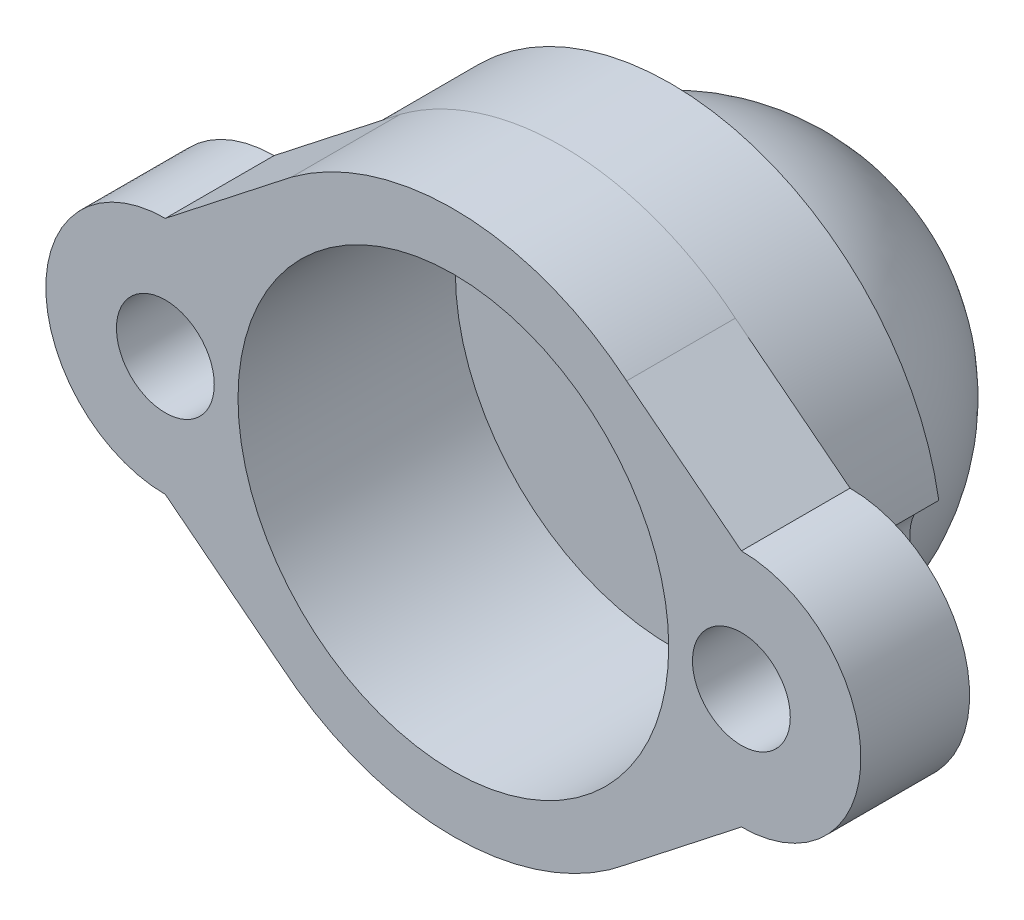
ISO-10303-21;
HEADER;
FILE_DESCRIPTION(('STEP AP214'),'2;1');
FILE_NAME('part.step','',(''),(''),'','','');
FILE_SCHEMA(('AUTOMOTIVE_DESIGN { 1 0 10303 214 1 1 1 1 }'));
ENDSEC;
DATA;
#1=APPLICATION_CONTEXT('core data for automotive mechanical design processes');
#2=APPLICATION_PROTOCOL_DEFINITION('international standard','automotive_design',2000,#1);
#3=PRODUCT_CONTEXT('',#1,'mechanical');
#4=PRODUCT('Part','Part','',(#3));
#5=PRODUCT_RELATED_PRODUCT_CATEGORY('part','',(#4));
#6=PRODUCT_DEFINITION_FORMATION('','',#4);
#7=PRODUCT_DEFINITION_CONTEXT('part definition',#1,'design');
#8=PRODUCT_DEFINITION('design','',#6,#7);
#9=PRODUCT_DEFINITION_SHAPE('','',#8);
#10=(LENGTH_UNIT() NAMED_UNIT(*) SI_UNIT(.MILLI.,.METRE.));
#11=(NAMED_UNIT(*) PLANE_ANGLE_UNIT() SI_UNIT($,.RADIAN.));
#12=(NAMED_UNIT(*) SI_UNIT($,.STERADIAN.) SOLID_ANGLE_UNIT());
#13=UNCERTAINTY_MEASURE_WITH_UNIT(LENGTH_MEASURE(1.E-05),#10,'distance_accuracy_value','');
#14=(GEOMETRIC_REPRESENTATION_CONTEXT(3) GLOBAL_UNCERTAINTY_ASSIGNED_CONTEXT((#13)) GLOBAL_UNIT_ASSIGNED_CONTEXT((#10,
#11,#12)) REPRESENTATION_CONTEXT('',''));
#15=CARTESIAN_POINT('',(0.,0.,0.));
#16=DIRECTION('',(0.,0.,1.));
#17=DIRECTION('',(1.,0.,0.));
#18=AXIS2_PLACEMENT_3D('',#15,#16,#17);
#19=CARTESIAN_POINT('',(-5.21556619172103,-6.6591934788986,2.54));
#20=DIRECTION('',(0.61660321136518,0.787274081711158,0.));
#21=DIRECTION('',(-0.787274081711158,0.61660321136518,0.));
#22=AXIS2_PLACEMENT_3D('',#19,#20,#21);
#23=PLANE('',#22);
#24=DIRECTION('',(0.787274081711159,-0.61660321136518,0.));
#25=VECTOR('',#24,1.);
#26=CARTESIAN_POINT('',(-5.21556619172103,-6.6591934788986,0.));
#27=LINE('',#26,#25);
#28=CARTESIAN_POINT('',(-5.57405324459235,-6.37842179700499,0.));
#29=VERTEX_POINT('',#28);
#30=CARTESIAN_POINT('',(-2.89267694980769,-8.47851028289685,0.));
#31=VERTEX_POINT('',#30);
#32=EDGE_CURVE('E149',#29,#31,#27,.T.);
#33=ORIENTED_EDGE('',*,*,#32,.T.);
#34=DIRECTION('',(0.,0.,-1.));
#35=VECTOR('',#34,1.);
#36=CARTESIAN_POINT('',(-2.89267694980769,-8.47851028289685,2.54));
#37=LINE('',#36,#35);
#38=CARTESIAN_POINT('',(-2.89267694980769,-8.47851028289685,2.54));
#39=VERTEX_POINT('',#38);
#40=EDGE_CURVE('E38',#39,#31,#37,.T.);
#41=ORIENTED_EDGE('',*,*,#40,.F.);
#42=DIRECTION('',(0.787274081711159,-0.61660321136518,0.));
#43=VECTOR('',#42,1.);
#44=CARTESIAN_POINT('',(-5.21556619172103,-6.6591934788986,2.54));
#45=LINE('',#44,#43);
#46=CARTESIAN_POINT('',(-5.57405324459235,-6.37842179700499,2.54));
#47=VERTEX_POINT('',#46);
#48=EDGE_CURVE('E158',#47,#39,#45,.T.);
#49=ORIENTED_EDGE('',*,*,#48,.F.);
#50=DIRECTION('',(0.,0.,-1.));
#51=VECTOR('',#50,1.);
#52=CARTESIAN_POINT('',(-5.57405324459235,-6.37842179700499,2.54));
#53=LINE('',#52,#51);
#54=EDGE_CURVE('E183',#47,#29,#53,.T.);
#55=ORIENTED_EDGE('',*,*,#54,.T.);
#56=EDGE_LOOP('',(#33,#41,#49,#55));
#57=FACE_BOUND('',#56,.T.);
#58=ADVANCED_FACE('F34',(#57),#23,.F.);
#59=CARTESIAN_POINT('',(1.15694675540765,-3.58442179700499,2.54));
#60=DIRECTION('',(0.,0.,-1.));
#61=DIRECTION('',(-1.,0.,0.));
#62=AXIS2_PLACEMENT_3D('',#59,#60,#61);
#63=CYLINDRICAL_SURFACE('',#62,6.35228732517518);
#64=CARTESIAN_POINT('',(1.15694675540765,-3.58442179700499,0.));
#65=DIRECTION('',(0.,0.,1.));
#66=DIRECTION('',(1.,0.,0.));
#67=AXIS2_PLACEMENT_3D('',#64,#65,#66);
#68=CIRCLE('',#67,6.35228732517518);
#69=CARTESIAN_POINT('',(5.20657046062299,-8.47851028289685,0.));
#70=VERTEX_POINT('',#69);
#71=EDGE_CURVE('E187',#31,#70,#68,.T.);
#72=ORIENTED_EDGE('',*,*,#71,.T.);
#73=DIRECTION('',(0.,0.,-1.));
#74=VECTOR('',#73,1.);
#75=CARTESIAN_POINT('',(5.20657046062299,-8.47851028289685,2.54));
#76=LINE('',#75,#74);
#77=CARTESIAN_POINT('',(5.20657046062299,-8.47851028289685,2.54));
#78=VERTEX_POINT('',#77);
#79=EDGE_CURVE('E220',#78,#70,#76,.T.);
#80=ORIENTED_EDGE('',*,*,#79,.F.);
#81=CARTESIAN_POINT('',(1.15694675540765,-3.58442179700499,2.54));
#82=DIRECTION('',(0.,0.,1.));
#83=DIRECTION('',(1.,0.,0.));
#84=AXIS2_PLACEMENT_3D('',#81,#82,#83);
#85=CIRCLE('',#84,6.35228732517518);
#86=EDGE_CURVE('E162',#39,#78,#85,.T.);
#87=ORIENTED_EDGE('',*,*,#86,.F.);
#88=ORIENTED_EDGE('',*,*,#40,.T.);
#89=EDGE_LOOP('',(#72,#80,#87,#88));
#90=FACE_BOUND('',#89,.T.);
#91=ADVANCED_FACE('F227',(#90),#63,.T.);
#92=CARTESIAN_POINT('',(6.09530739447928,-7.78244005753957,2.54));
#93=DIRECTION('',(0.61660321136518,-0.787274081711159,0.));
#94=DIRECTION('',(0.787274081711158,0.61660321136518,0.));
#95=AXIS2_PLACEMENT_3D('',#92,#93,#94);
#96=PLANE('',#95);
#97=DIRECTION('',(-0.787274081711158,-0.616603211365179,0.));
#98=VECTOR('',#97,1.);
#99=CARTESIAN_POINT('',(6.09530739447928,-7.78244005753957,0.));
#100=LINE('',#99,#98);
#101=CARTESIAN_POINT('',(7.88794675540765,-6.37842179700499,0.));
#102=VERTEX_POINT('',#101);
#103=EDGE_CURVE('E190',#102,#70,#100,.T.);
#104=ORIENTED_EDGE('',*,*,#103,.F.);
#105=DIRECTION('',(0.,0.,-1.));
#106=VECTOR('',#105,1.);
#107=CARTESIAN_POINT('',(7.88794675540765,-6.37842179700499,2.54));
#108=LINE('',#107,#106);
#109=CARTESIAN_POINT('',(7.88794675540765,-6.37842179700499,2.54));
#110=VERTEX_POINT('',#109);
#111=EDGE_CURVE('E219',#110,#102,#108,.T.);
#112=ORIENTED_EDGE('',*,*,#111,.F.);
#113=DIRECTION('',(-0.787274081711158,-0.616603211365179,0.));
#114=VECTOR('',#113,1.);
#115=CARTESIAN_POINT('',(6.09530739447928,-7.78244005753957,2.54));
#116=LINE('',#115,#114);
#117=EDGE_CURVE('E164',#110,#78,#116,.T.);
#118=ORIENTED_EDGE('',*,*,#117,.T.);
#119=ORIENTED_EDGE('',*,*,#79,.T.);
#120=EDGE_LOOP('',(#104,#112,#118,#119));
#121=FACE_BOUND('',#120,.T.);
#122=ADVANCED_FACE('F237',(#121),#96,.T.);
#123=CARTESIAN_POINT('',(7.88794675540765,-3.58442179700499,2.54));
#124=DIRECTION('',(0.,0.,-1.));
#125=DIRECTION('',(-1.,0.,0.));
#126=AXIS2_PLACEMENT_3D('',#123,#124,#125);
#127=CYLINDRICAL_SURFACE('',#126,2.794);
#128=CARTESIAN_POINT('',(7.88794675540765,-3.58442179700499,0.));
#129=DIRECTION('',(0.,0.,1.));
#130=DIRECTION('',(1.,0.,0.));
#131=AXIS2_PLACEMENT_3D('',#128,#129,#130);
#132=CIRCLE('',#131,2.794);
#133=CARTESIAN_POINT('',(7.88794675540765,-0.790421797004992,0.));
#134=VERTEX_POINT('',#133);
#135=EDGE_CURVE('E193',#102,#134,#132,.T.);
#136=ORIENTED_EDGE('',*,*,#135,.T.);
#137=DIRECTION('',(0.,0.,-1.));
#138=VECTOR('',#137,1.);
#139=CARTESIAN_POINT('',(7.88794675540765,-0.790421797004992,2.54));
#140=LINE('',#139,#138);
#141=CARTESIAN_POINT('',(7.88794675540765,-0.790421797004992,2.54));
#142=VERTEX_POINT('',#141);
#143=EDGE_CURVE('E216',#142,#134,#140,.T.);
#144=ORIENTED_EDGE('',*,*,#143,.F.);
#145=CARTESIAN_POINT('',(7.88794675540765,-3.58442179700499,2.54));
#146=DIRECTION('',(0.,0.,1.));
#147=DIRECTION('',(1.,0.,0.));
#148=AXIS2_PLACEMENT_3D('',#145,#146,#147);
#149=CIRCLE('',#148,2.794);
#150=EDGE_CURVE('E167',#110,#142,#149,.T.);
#151=ORIENTED_EDGE('',*,*,#150,.F.);
#152=ORIENTED_EDGE('',*,*,#111,.T.);
#153=EDGE_LOOP('',(#136,#144,#151,#152));
#154=FACE_BOUND('',#153,.T.);
#155=ADVANCED_FACE('F242',(#154),#127,.T.);
#156=CARTESIAN_POINT('',(2.61529459261675,3.33918735883311,2.54));
#157=DIRECTION('',(-0.61660321136518,-0.787274081711158,0.));
#158=DIRECTION('',(0.787274081711159,-0.61660321136518,0.));
#159=AXIS2_PLACEMENT_3D('',#156,#157,#158);
#160=PLANE('',#159);
#161=DIRECTION('',(-0.787274081711158,0.61660321136518,0.));
#162=VECTOR('',#161,1.);
#163=CARTESIAN_POINT('',(2.61529459261675,3.33918735883311,0.));
#164=LINE('',#163,#162);
#165=CARTESIAN_POINT('',(5.20657046062299,1.30966668888687,0.));
#166=VERTEX_POINT('',#165);
#167=EDGE_CURVE('E195',#134,#166,#164,.T.);
#168=ORIENTED_EDGE('',*,*,#167,.T.);
#169=DIRECTION('',(0.,0.,-1.));
#170=VECTOR('',#169,1.);
#171=CARTESIAN_POINT('',(5.20657046062299,1.30966668888687,2.54));
#172=LINE('',#171,#170);
#173=CARTESIAN_POINT('',(5.20657046062299,1.30966668888687,2.54));
#174=VERTEX_POINT('',#173);
#175=EDGE_CURVE('E213',#174,#166,#172,.T.);
#176=ORIENTED_EDGE('',*,*,#175,.F.);
#177=DIRECTION('',(-0.787274081711158,0.61660321136518,0.));
#178=VECTOR('',#177,1.);
#179=CARTESIAN_POINT('',(2.61529459261675,3.33918735883311,2.54));
#180=LINE('',#179,#178);
#181=EDGE_CURVE('E169',#142,#174,#180,.T.);
#182=ORIENTED_EDGE('',*,*,#181,.F.);
#183=ORIENTED_EDGE('',*,*,#143,.T.);
#184=EDGE_LOOP('',(#168,#176,#182,#183));
#185=FACE_BOUND('',#184,.T.);
#186=ADVANCED_FACE('F293',(#185),#160,.F.);
#187=CARTESIAN_POINT('',(1.15694675540765,-3.58442179700499,2.54));
#188=DIRECTION('',(0.,0.,-1.));
#189=DIRECTION('',(-1.,0.,0.));
#190=AXIS2_PLACEMENT_3D('',#187,#188,#189);
#191=CYLINDRICAL_SURFACE('',#190,6.35228732517518);
#192=CARTESIAN_POINT('',(1.15694675540765,-3.58442179700499,0.));
#193=DIRECTION('',(0.,0.,1.));
#194=DIRECTION('',(1.,0.,0.));
#195=AXIS2_PLACEMENT_3D('',#192,#193,#194);
#196=CIRCLE('',#195,6.35228732517518);
#197=CARTESIAN_POINT('',(-2.62429032371479,1.51987055483487,0.));
#198=VERTEX_POINT('',#197);
#199=EDGE_CURVE('E197',#166,#198,#196,.T.);
#200=ORIENTED_EDGE('',*,*,#199,.T.);
#201=DIRECTION('',(0.,0.,-1.));
#202=VECTOR('',#201,1.);
#203=CARTESIAN_POINT('',(-2.62429032371479,1.51987055483487,2.54));
#204=LINE('',#203,#202);
#205=CARTESIAN_POINT('',(-2.62429032371479,1.51987055483487,2.54));
#206=VERTEX_POINT('',#205);
#207=EDGE_CURVE('E210',#206,#198,#204,.T.);
#208=ORIENTED_EDGE('',*,*,#207,.F.);
#209=CARTESIAN_POINT('',(1.15694675540765,-3.58442179700499,2.54));
#210=DIRECTION('',(0.,0.,1.));
#211=DIRECTION('',(1.,0.,0.));
#212=AXIS2_PLACEMENT_3D('',#209,#210,#211);
#213=CIRCLE('',#212,6.35228732517518);
#214=EDGE_CURVE('E171',#174,#206,#213,.T.);
#215=ORIENTED_EDGE('',*,*,#214,.F.);
#216=ORIENTED_EDGE('',*,*,#175,.T.);
#217=EDGE_LOOP('',(#200,#208,#215,#216));
#218=FACE_BOUND('',#217,.T.);
#219=ADVANCED_FACE('F296',(#218),#191,.T.);
#220=CARTESIAN_POINT('',(-1.7355533898585,2.21594078019214,2.54));
#221=DIRECTION('',(-0.616603211365179,0.787274081711159,0.));
#222=DIRECTION('',(-0.787274081711159,-0.616603211365179,0.));
#223=AXIS2_PLACEMENT_3D('',#220,#221,#222);
#224=PLANE('',#223);
#225=DIRECTION('',(0.787274081711159,0.616603211365179,0.));
#226=VECTOR('',#225,1.);
#227=CARTESIAN_POINT('',(-1.7355533898585,2.21594078019214,0.));
#228=LINE('',#227,#226);
#229=CARTESIAN_POINT('',(-5.57405324459234,-0.790421797004991,0.));
#230=VERTEX_POINT('',#229);
#231=CARTESIAN_POINT('',(-2.75848363676124,1.41476862186087,0.));
#232=VERTEX_POINT('',#231);
#233=EDGE_CURVE('E201',#230,#232,#228,.T.);
#234=ORIENTED_EDGE('',*,*,#233,.F.);
#235=DIRECTION('',(0.,0.,-1.));
#236=VECTOR('',#235,1.);
#237=CARTESIAN_POINT('',(-5.57405324459234,-0.790421797004991,2.54));
#238=LINE('',#237,#236);
#239=CARTESIAN_POINT('',(-5.57405324459234,-0.790421797004991,2.54));
#240=VERTEX_POINT('',#239);
#241=EDGE_CURVE('E208',#240,#230,#238,.T.);
#242=ORIENTED_EDGE('',*,*,#241,.F.);
#243=DIRECTION('',(0.787274081711159,0.616603211365179,0.));
#244=VECTOR('',#243,1.);
#245=CARTESIAN_POINT('',(-1.7355533898585,2.21594078019214,2.54));
#246=LINE('',#245,#244);
#247=EDGE_CURVE('E173',#240,#206,#246,.T.);
#248=ORIENTED_EDGE('',*,*,#247,.T.);
#249=ORIENTED_EDGE('',*,*,#207,.T.);
#250=EDGE_CURVE('E200',#232,#198,#228,.T.);
#251=ORIENTED_EDGE('',*,*,#250,.F.);
#252=EDGE_LOOP('',(#234,#242,#248,#249,#251));
#253=FACE_BOUND('',#252,.T.);
#254=ADVANCED_FACE('F252',(#253),#224,.T.);
#255=CARTESIAN_POINT('',(-5.57405324459235,-3.58442179700499,2.54));
#256=DIRECTION('',(0.,0.,-1.));
#257=DIRECTION('',(-1.,0.,0.));
#258=AXIS2_PLACEMENT_3D('',#255,#256,#257);
#259=CYLINDRICAL_SURFACE('',#258,1.143);
#260=CARTESIAN_POINT('',(-5.57405324459235,-3.58442179700499,2.54));
#261=DIRECTION('',(0.,0.,1.));
#262=DIRECTION('',(1.,0.,0.));
#263=AXIS2_PLACEMENT_3D('',#260,#261,#262);
#264=CIRCLE('',#263,1.143);
#265=CARTESIAN_POINT('',(-4.43105324459235,-3.58442179700499,2.54));
#266=VERTEX_POINT('',#265);
#267=EDGE_CURVE('E178',#266,#266,#264,.T.);
#268=ORIENTED_EDGE('',*,*,#267,.T.);
#269=EDGE_LOOP('',(#268));
#270=FACE_BOUND('',#269,.T.);
#271=CARTESIAN_POINT('',(-5.57405324459235,-3.58442179700499,0.));
#272=DIRECTION('',(0.,0.,1.));
#273=DIRECTION('',(1.,0.,0.));
#274=AXIS2_PLACEMENT_3D('',#271,#272,#273);
#275=CIRCLE('',#274,1.143);
#276=CARTESIAN_POINT('',(-5.10678909364895,-2.54129514446315,0.));
#277=VERTEX_POINT('',#276);
#278=CARTESIAN_POINT('',(-5.10678909364895,-4.62754844954683,0.));
#279=VERTEX_POINT('',#278);
#280=EDGE_CURVE('E159',#277,#279,#275,.T.);
#281=ORIENTED_EDGE('',*,*,#280,.F.);
#282=DIRECTION('',(0.,0.,1.));
#283=VECTOR('',#282,1.);
#284=CARTESIAN_POINT('',(-5.10678909364895,-2.54129514446315,-2.54));
#285=LINE('',#284,#283);
#286=CARTESIAN_POINT('',(-5.10678909364895,-2.54129514446315,-2.54));
#287=VERTEX_POINT('',#286);
#288=EDGE_CURVE('E151',#287,#277,#285,.T.);
#289=ORIENTED_EDGE('',*,*,#288,.F.);
#290=CARTESIAN_POINT('',(-5.57405324459235,-3.58442179700499,-2.54));
#291=DIRECTION('',(0.,0.,1.));
#292=DIRECTION('',(-1.,0.,0.));
#293=AXIS2_PLACEMENT_3D('',#290,#291,#292);
#294=CIRCLE('',#293,1.143);
#295=CARTESIAN_POINT('',(-5.10678909364895,-4.62754844954683,-2.54));
#296=VERTEX_POINT('',#295);
#297=EDGE_CURVE('E135',#296,#287,#294,.T.);
#298=ORIENTED_EDGE('',*,*,#297,.F.);
#299=DIRECTION('',(0.,0.,1.));
#300=VECTOR('',#299,1.);
#301=CARTESIAN_POINT('',(-5.10678909364895,-4.62754844954683,-2.54));
#302=LINE('',#301,#300);
#303=EDGE_CURVE('E132',#296,#279,#302,.T.);
#304=ORIENTED_EDGE('',*,*,#303,.T.);
#305=EDGE_LOOP('',(#281,#289,#298,#304));
#306=FACE_BOUND('',#305,.T.);
#307=ADVANCED_FACE('F303',(#270,#306),#259,.F.);
#308=CARTESIAN_POINT('',(-5.57405324459235,-3.58442179700499,2.54));
#309=DIRECTION('',(0.,0.,-1.));
#310=DIRECTION('',(-1.,0.,0.));
#311=AXIS2_PLACEMENT_3D('',#308,#309,#310);
#312=CYLINDRICAL_SURFACE('',#311,2.794);
#313=CARTESIAN_POINT('',(-5.57405324459235,-3.58442179700499,0.));
#314=DIRECTION('',(0.,0.,1.));
#315=DIRECTION('',(1.,0.,0.));
#316=AXIS2_PLACEMENT_3D('',#313,#314,#315);
#317=CIRCLE('',#316,2.794);
#318=EDGE_CURVE('E203',#230,#29,#317,.T.);
#319=ORIENTED_EDGE('',*,*,#318,.T.);
#320=ORIENTED_EDGE('',*,*,#54,.F.);
#321=CARTESIAN_POINT('',(-5.57405324459235,-3.58442179700499,2.54));
#322=DIRECTION('',(0.,0.,1.));
#323=DIRECTION('',(1.,0.,0.));
#324=AXIS2_PLACEMENT_3D('',#321,#322,#323);
#325=CIRCLE('',#324,2.794);
#326=EDGE_CURVE('E176',#240,#47,#325,.T.);
#327=ORIENTED_EDGE('',*,*,#326,.F.);
#328=ORIENTED_EDGE('',*,*,#241,.T.);
#329=EDGE_LOOP('',(#319,#320,#327,#328));
#330=FACE_BOUND('',#329,.T.);
#331=ADVANCED_FACE('F250',(#330),#312,.T.);
#332=CARTESIAN_POINT('',(7.88794675540765,-3.58442179700499,2.54));
#333=DIRECTION('',(0.,0.,-1.));
#334=DIRECTION('',(-1.,0.,0.));
#335=AXIS2_PLACEMENT_3D('',#332,#333,#334);
#336=CYLINDRICAL_SURFACE('',#335,1.143);
#337=CARTESIAN_POINT('',(7.88794675540765,-3.58442179700499,2.54));
#338=DIRECTION('',(0.,0.,1.));
#339=DIRECTION('',(1.,0.,0.));
#340=AXIS2_PLACEMENT_3D('',#337,#338,#339);
#341=CIRCLE('',#340,1.143);
#342=CARTESIAN_POINT('',(9.03094675540765,-3.58442179700499,2.54));
#343=VERTEX_POINT('',#342);
#344=EDGE_CURVE('E155',#343,#343,#341,.T.);
#345=ORIENTED_EDGE('',*,*,#344,.T.);
#346=EDGE_LOOP('',(#345));
#347=FACE_BOUND('',#346,.T.);
#348=CARTESIAN_POINT('',(7.88794675540765,-3.58442179700499,0.));
#349=DIRECTION('',(0.,0.,1.));
#350=DIRECTION('',(1.,0.,0.));
#351=AXIS2_PLACEMENT_3D('',#348,#349,#350);
#352=CIRCLE('',#351,1.143);
#353=CARTESIAN_POINT('',(7.42068260446426,-4.62754844954683,0.));
#354=VERTEX_POINT('',#353);
#355=CARTESIAN_POINT('',(7.42068260446426,-2.54129514446315,0.));
#356=VERTEX_POINT('',#355);
#357=EDGE_CURVE('E147',#354,#356,#352,.T.);
#358=ORIENTED_EDGE('',*,*,#357,.F.);
#359=DIRECTION('',(0.,0.,1.));
#360=VECTOR('',#359,1.);
#361=CARTESIAN_POINT('',(7.42068260446426,-4.62754844954683,-2.54));
#362=LINE('',#361,#360);
#363=CARTESIAN_POINT('',(7.42068260446426,-4.62754844954683,-2.54));
#364=VERTEX_POINT('',#363);
#365=EDGE_CURVE('E130',#364,#354,#362,.T.);
#366=ORIENTED_EDGE('',*,*,#365,.F.);
#367=CARTESIAN_POINT('',(7.88794675540765,-3.58442179700499,-2.54));
#368=DIRECTION('',(0.,0.,1.));
#369=DIRECTION('',(-1.,0.,0.));
#370=AXIS2_PLACEMENT_3D('',#367,#368,#369);
#371=CIRCLE('',#370,1.143);
#372=CARTESIAN_POINT('',(7.42068260446426,-2.54129514446315,-2.54));
#373=VERTEX_POINT('',#372);
#374=EDGE_CURVE('E136',#373,#364,#371,.T.);
#375=ORIENTED_EDGE('',*,*,#374,.F.);
#376=DIRECTION('',(0.,0.,1.));
#377=VECTOR('',#376,1.);
#378=CARTESIAN_POINT('',(7.42068260446426,-2.54129514446315,-2.54));
#379=LINE('',#378,#377);
#380=EDGE_CURVE('E262',#373,#356,#379,.T.);
#381=ORIENTED_EDGE('',*,*,#380,.T.);
#382=EDGE_LOOP('',(#358,#366,#375,#381));
#383=FACE_BOUND('',#382,.T.);
#384=ADVANCED_FACE('F36',(#347,#383),#336,.F.);
#385=CARTESIAN_POINT('',(1.15694675540765,-3.58442179700499,2.54));
#386=DIRECTION('',(0.,0.,-1.));
#387=DIRECTION('',(-1.,0.,0.));
#388=AXIS2_PLACEMENT_3D('',#385,#386,#387);
#389=CYLINDRICAL_SURFACE('',#388,5.0330227);
#390=CARTESIAN_POINT('',(1.15694675540765,-3.58442179700499,2.54));
#391=DIRECTION('',(0.,0.,1.));
#392=DIRECTION('',(1.,0.,0.));
#393=AXIS2_PLACEMENT_3D('',#390,#391,#392);
#394=CIRCLE('',#393,5.0330227);
#395=CARTESIAN_POINT('',(6.18996945540765,-3.58442179700499,2.54));
#396=VERTEX_POINT('',#395);
#397=EDGE_CURVE('E181',#396,#396,#394,.T.);
#398=ORIENTED_EDGE('',*,*,#397,.T.);
#399=EDGE_LOOP('',(#398));
#400=FACE_BOUND('',#399,.T.);
#401=CARTESIAN_POINT('',(1.15694675540765,-3.58442179700499,-2.54));
#402=DIRECTION('',(0.,0.,-1.));
#403=DIRECTION('',(-1.,0.,0.));
#404=AXIS2_PLACEMENT_3D('',#401,#402,#403);
#405=CIRCLE('',#404,5.0330227);
#406=CARTESIAN_POINT('',(-3.87607594459235,-3.58442179700499,-2.54));
#407=VERTEX_POINT('',#406);
#408=EDGE_CURVE('E258',#407,#407,#405,.T.);
#409=ORIENTED_EDGE('',*,*,#408,.T.);
#410=EDGE_LOOP('',(#409));
#411=FACE_BOUND('',#410,.T.);
#412=ADVANCED_FACE('F309',(#400,#411),#389,.F.);
#413=CARTESIAN_POINT('',(0.,0.,2.54));
#414=DIRECTION('',(0.,0.,1.));
#415=DIRECTION('',(1.,0.,0.));
#416=AXIS2_PLACEMENT_3D('',#413,#414,#415);
#417=PLANE('',#416);
#418=ORIENTED_EDGE('',*,*,#344,.F.);
#419=EDGE_LOOP('',(#418));
#420=FACE_BOUND('',#419,.T.);
#421=ORIENTED_EDGE('',*,*,#48,.T.);
#422=ORIENTED_EDGE('',*,*,#86,.T.);
#423=ORIENTED_EDGE('',*,*,#117,.F.);
#424=ORIENTED_EDGE('',*,*,#150,.T.);
#425=ORIENTED_EDGE('',*,*,#181,.T.);
#426=ORIENTED_EDGE('',*,*,#214,.T.);
#427=ORIENTED_EDGE('',*,*,#247,.F.);
#428=ORIENTED_EDGE('',*,*,#326,.T.);
#429=EDGE_LOOP('',(#421,#422,#423,#424,#425,#426,#427,#428));
#430=FACE_BOUND('',#429,.T.);
#431=ORIENTED_EDGE('',*,*,#267,.F.);
#432=EDGE_LOOP('',(#431));
#433=FACE_BOUND('',#432,.T.);
#434=ORIENTED_EDGE('',*,*,#397,.F.);
#435=EDGE_LOOP('',(#434));
#436=FACE_BOUND('',#435,.T.);
#437=ADVANCED_FACE('F245',(#420,#430,#433,#436),#417,.T.);
#438=CARTESIAN_POINT('',(0.,0.,0.));
#439=DIRECTION('',(0.,0.,1.));
#440=DIRECTION('',(1.,0.,0.));
#441=AXIS2_PLACEMENT_3D('',#438,#439,#440);
#442=PLANE('',#441);
#443=CARTESIAN_POINT('',(1.15694675540765,-3.58442179700499,0.));
#444=DIRECTION('',(0.,0.,-1.));
#445=DIRECTION('',(-1.,0.,0.));
#446=AXIS2_PLACEMENT_3D('',#443,#444,#445);
#447=CIRCLE('',#446,6.35);
#448=EDGE_CURVE('E44',#277,#232,#447,.T.);
#449=ORIENTED_EDGE('',*,*,#448,.F.);
#450=ORIENTED_EDGE('',*,*,#280,.T.);
#451=CARTESIAN_POINT('',(1.15694675540765,-3.58442179700499,0.));
#452=DIRECTION('',(0.,0.,-1.));
#453=DIRECTION('',(-1.,0.,0.));
#454=AXIS2_PLACEMENT_3D('',#451,#452,#453);
#455=CIRCLE('',#454,6.35);
#456=EDGE_CURVE('E257',#354,#279,#455,.T.);
#457=ORIENTED_EDGE('',*,*,#456,.F.);
#458=ORIENTED_EDGE('',*,*,#357,.T.);
#459=EDGE_CURVE('E11',#232,#356,#447,.T.);
#460=ORIENTED_EDGE('',*,*,#459,.F.);
#461=ORIENTED_EDGE('',*,*,#250,.T.);
#462=ORIENTED_EDGE('',*,*,#199,.F.);
#463=ORIENTED_EDGE('',*,*,#167,.F.);
#464=ORIENTED_EDGE('',*,*,#135,.F.);
#465=ORIENTED_EDGE('',*,*,#103,.T.);
#466=ORIENTED_EDGE('',*,*,#71,.F.);
#467=ORIENTED_EDGE('',*,*,#32,.F.);
#468=ORIENTED_EDGE('',*,*,#318,.F.);
#469=ORIENTED_EDGE('',*,*,#233,.T.);
#470=EDGE_LOOP('',(#449,#450,#457,#458,#460,#461,#462,#463,#464,#465,#466,#467,#468,#469));
#471=FACE_BOUND('',#470,.T.);
#472=ADVANCED_FACE('F233',(#471),#442,.F.);
#473=CARTESIAN_POINT('',(4.52244675540765,-3.58442179700499,-2.54));
#474=DIRECTION('',(0.,0.,-1.));
#475=DIRECTION('',(-1.,0.,0.));
#476=AXIS2_PLACEMENT_3D('',#473,#474,#475);
#477=PLANE('',#476);
#478=CARTESIAN_POINT('',(1.15694675540765,-3.58442179700499,-2.54));
#479=DIRECTION('',(0.,0.,1.));
#480=DIRECTION('',(1.,0.,0.));
#481=AXIS2_PLACEMENT_3D('',#478,#479,#480);
#482=CIRCLE('',#481,5.08);
#483=CARTESIAN_POINT('',(6.23694675540765,-3.58442179700499,-2.54));
#484=VERTEX_POINT('',#483);
#485=EDGE_CURVE('E267',#484,#484,#482,.T.);
#486=ORIENTED_EDGE('',*,*,#485,.T.);
#487=EDGE_LOOP('',(#486));
#488=FACE_BOUND('',#487,.T.);
#489=ORIENTED_EDGE('',*,*,#374,.T.);
#490=CARTESIAN_POINT('',(1.15694675540765,-3.58442179700499,-2.54));
#491=DIRECTION('',(0.,0.,-1.));
#492=DIRECTION('',(-1.,0.,0.));
#493=AXIS2_PLACEMENT_3D('',#490,#491,#492);
#494=CIRCLE('',#493,6.35);
#495=EDGE_CURVE('E125',#364,#296,#494,.T.);
#496=ORIENTED_EDGE('',*,*,#495,.T.);
#497=ORIENTED_EDGE('',*,*,#297,.T.);
#498=CARTESIAN_POINT('',(1.15694675540765,-3.58442179700499,-2.54));
#499=DIRECTION('',(0.,0.,-1.));
#500=DIRECTION('',(-1.,0.,0.));
#501=AXIS2_PLACEMENT_3D('',#498,#499,#500);
#502=CIRCLE('',#501,6.35);
#503=EDGE_CURVE('E141',#287,#373,#502,.T.);
#504=ORIENTED_EDGE('',*,*,#503,.T.);
#505=EDGE_LOOP('',(#489,#496,#497,#504));
#506=FACE_BOUND('',#505,.T.);
#507=ADVANCED_FACE('F139',(#488,#506),#477,.T.);
#508=CARTESIAN_POINT('',(1.15694675540765,-3.58442179700499,-2.54));
#509=DIRECTION('',(0.,0.,1.));
#510=DIRECTION('',(1.,0.,0.));
#511=AXIS2_PLACEMENT_3D('',#508,#509,#510);
#512=CYLINDRICAL_SURFACE('',#511,6.35);
#513=ORIENTED_EDGE('',*,*,#456,.T.);
#514=ORIENTED_EDGE('',*,*,#303,.F.);
#515=ORIENTED_EDGE('',*,*,#495,.F.);
#516=ORIENTED_EDGE('',*,*,#365,.T.);
#517=EDGE_LOOP('',(#513,#514,#515,#516));
#518=FACE_BOUND('',#517,.T.);
#519=ADVANCED_FACE('F128',(#518),#512,.T.);
#520=CARTESIAN_POINT('',(1.15694675540765,-3.58442179700499,-2.54));
#521=DIRECTION('',(0.,0.,1.));
#522=DIRECTION('',(1.,0.,0.));
#523=AXIS2_PLACEMENT_3D('',#520,#521,#522);
#524=CYLINDRICAL_SURFACE('',#523,6.35);
#525=ORIENTED_EDGE('',*,*,#448,.T.);
#526=ORIENTED_EDGE('',*,*,#459,.T.);
#527=ORIENTED_EDGE('',*,*,#380,.F.);
#528=ORIENTED_EDGE('',*,*,#503,.F.);
#529=ORIENTED_EDGE('',*,*,#288,.T.);
#530=EDGE_LOOP('',(#525,#526,#527,#528,#529));
#531=FACE_BOUND('',#530,.T.);
#532=ADVANCED_FACE('F255',(#531),#524,.T.);
#533=CARTESIAN_POINT('',(1.15694675540765,-3.58442179700499,-2.54));
#534=DIRECTION('',(0.,0.,1.));
#535=DIRECTION('',(0.,1.,0.));
#536=AXIS2_PLACEMENT_3D('',#533,#534,#535);
#537=SPHERICAL_SURFACE('',#536,5.08);
#538=ORIENTED_EDGE('',*,*,#485,.F.);
#539=EDGE_LOOP('',(#538));
#540=FACE_BOUND('',#539,.T.);
#541=ADVANCED_FACE('F272',(#540),#537,.T.);
#542=CARTESIAN_POINT('',(1.15694675540765,-3.58442179700499,-2.54));
#543=DIRECTION('',(0.,0.,-1.));
#544=DIRECTION('',(-1.,0.,0.));
#545=AXIS2_PLACEMENT_3D('',#542,#543,#544);
#546=PLANE('',#545);
#547=ORIENTED_EDGE('',*,*,#408,.F.);
#548=EDGE_LOOP('',(#547));
#549=FACE_BOUND('',#548,.T.);
#550=ADVANCED_FACE('F274',(#549),#546,.F.);
#551=CLOSED_SHELL('',(#58,#91,#122,#155,#186,#219,#254,#307,#331,#384,#412,#437,#472,#507,#519,
#532,#541,#550));
#552=MANIFOLD_SOLID_BREP('B2',#551);
#553=ADVANCED_BREP_SHAPE_REPRESENTATION('',(#18,#552),#14);
#554=SHAPE_DEFINITION_REPRESENTATION(#9,#553);
ENDSEC;
END-ISO-10303-21;
